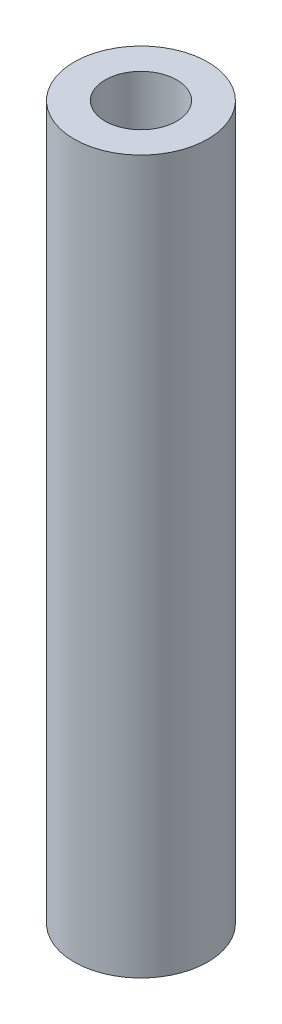
ISO-10303-21;
HEADER;
FILE_DESCRIPTION(('STEP AP214'),'2;1');
FILE_NAME('part.step','',(''),(''),'','','');
FILE_SCHEMA(('AUTOMOTIVE_DESIGN { 1 0 10303 214 1 1 1 1 }'));
ENDSEC;
DATA;
#1=APPLICATION_CONTEXT('core data for automotive mechanical design processes');
#2=APPLICATION_PROTOCOL_DEFINITION('international standard','automotive_design',2000,#1);
#3=PRODUCT_CONTEXT('',#1,'mechanical');
#4=PRODUCT('Part','Part','',(#3));
#5=PRODUCT_RELATED_PRODUCT_CATEGORY('part','',(#4));
#6=PRODUCT_DEFINITION_FORMATION('','',#4);
#7=PRODUCT_DEFINITION_CONTEXT('part definition',#1,'design');
#8=PRODUCT_DEFINITION('design','',#6,#7);
#9=PRODUCT_DEFINITION_SHAPE('','',#8);
#10=(LENGTH_UNIT() NAMED_UNIT(*) SI_UNIT(.MILLI.,.METRE.));
#11=(NAMED_UNIT(*) PLANE_ANGLE_UNIT() SI_UNIT($,.RADIAN.));
#12=(NAMED_UNIT(*) SI_UNIT($,.STERADIAN.) SOLID_ANGLE_UNIT());
#13=UNCERTAINTY_MEASURE_WITH_UNIT(LENGTH_MEASURE(1.E-05),#10,'distance_accuracy_value','');
#14=(GEOMETRIC_REPRESENTATION_CONTEXT(3) GLOBAL_UNCERTAINTY_ASSIGNED_CONTEXT((#13)) GLOBAL_UNIT_ASSIGNED_CONTEXT((#10,
#11,#12)) REPRESENTATION_CONTEXT('',''));
#15=CARTESIAN_POINT('',(0.,0.,0.));
#16=DIRECTION('',(0.,0.,1.));
#17=DIRECTION('',(1.,0.,0.));
#18=AXIS2_PLACEMENT_3D('',#15,#16,#17);
#19=CARTESIAN_POINT('',(0.,25.4,0.));
#20=DIRECTION('',(0.,1.,0.));
#21=DIRECTION('',(0.,0.,1.));
#22=AXIS2_PLACEMENT_3D('',#19,#20,#21);
#23=PLANE('',#22);
#24=CARTESIAN_POINT('',(0.,25.4,0.));
#25=DIRECTION('',(0.,1.,0.));
#26=DIRECTION('',(0.,0.,1.));
#27=AXIS2_PLACEMENT_3D('',#24,#25,#26);
#28=CIRCLE('',#27,4.7625);
#29=CARTESIAN_POINT('',(0.,25.4,4.7625));
#30=VERTEX_POINT('',#29);
#31=EDGE_CURVE('E10',#30,#30,#28,.T.);
#32=ORIENTED_EDGE('',*,*,#31,.T.);
#33=EDGE_LOOP('',(#32));
#34=FACE_BOUND('',#33,.T.);
#35=CARTESIAN_POINT('',(0.,25.4,0.));
#36=DIRECTION('',(0.,1.,0.));
#37=DIRECTION('',(0.,0.,1.));
#38=AXIS2_PLACEMENT_3D('',#35,#36,#37);
#39=CIRCLE('',#38,2.5527);
#40=CARTESIAN_POINT('',(0.,25.4,2.5527));
#41=VERTEX_POINT('',#40);
#42=EDGE_CURVE('E44',#41,#41,#39,.T.);
#43=ORIENTED_EDGE('',*,*,#42,.F.);
#44=EDGE_LOOP('',(#43));
#45=FACE_BOUND('',#44,.T.);
#46=ADVANCED_FACE('F33',(#34,#45),#23,.T.);
#47=CARTESIAN_POINT('',(0.,-25.4,0.));
#48=DIRECTION('',(0.,1.,0.));
#49=DIRECTION('',(0.,0.,1.));
#50=AXIS2_PLACEMENT_3D('',#47,#48,#49);
#51=PLANE('',#50);
#52=CARTESIAN_POINT('',(0.,-25.4,0.));
#53=DIRECTION('',(0.,1.,0.));
#54=DIRECTION('',(0.,0.,1.));
#55=AXIS2_PLACEMENT_3D('',#52,#53,#54);
#56=CIRCLE('',#55,4.7625);
#57=CARTESIAN_POINT('',(0.,-25.4,4.7625));
#58=VERTEX_POINT('',#57);
#59=EDGE_CURVE('E37',#58,#58,#56,.T.);
#60=ORIENTED_EDGE('',*,*,#59,.F.);
#61=EDGE_LOOP('',(#60));
#62=FACE_BOUND('',#61,.T.);
#63=CARTESIAN_POINT('',(0.,-25.4,0.));
#64=DIRECTION('',(0.,1.,0.));
#65=DIRECTION('',(0.,0.,1.));
#66=AXIS2_PLACEMENT_3D('',#63,#64,#65);
#67=CIRCLE('',#66,2.5527);
#68=CARTESIAN_POINT('',(0.,-25.4,2.5527));
#69=VERTEX_POINT('',#68);
#70=EDGE_CURVE('E46',#69,#69,#67,.T.);
#71=ORIENTED_EDGE('',*,*,#70,.T.);
#72=EDGE_LOOP('',(#71));
#73=FACE_BOUND('',#72,.T.);
#74=ADVANCED_FACE('F56',(#62,#73),#51,.F.);
#75=CARTESIAN_POINT('',(0.,25.4,0.));
#76=DIRECTION('',(0.,-1.,0.));
#77=DIRECTION('',(0.,0.,-1.));
#78=AXIS2_PLACEMENT_3D('',#75,#76,#77);
#79=CYLINDRICAL_SURFACE('',#78,4.7625);
#80=ORIENTED_EDGE('',*,*,#31,.F.);
#81=EDGE_LOOP('',(#80));
#82=FACE_BOUND('',#81,.T.);
#83=ORIENTED_EDGE('',*,*,#59,.T.);
#84=EDGE_LOOP('',(#83));
#85=FACE_BOUND('',#84,.T.);
#86=ADVANCED_FACE('F35',(#82,#85),#79,.T.);
#87=CARTESIAN_POINT('',(0.,25.4,0.));
#88=DIRECTION('',(0.,-1.,0.));
#89=DIRECTION('',(0.,0.,-1.));
#90=AXIS2_PLACEMENT_3D('',#87,#88,#89);
#91=CYLINDRICAL_SURFACE('',#90,2.5527);
#92=ORIENTED_EDGE('',*,*,#42,.T.);
#93=EDGE_LOOP('',(#92));
#94=FACE_BOUND('',#93,.T.);
#95=ORIENTED_EDGE('',*,*,#70,.F.);
#96=EDGE_LOOP('',(#95));
#97=FACE_BOUND('',#96,.T.);
#98=ADVANCED_FACE('F52',(#94,#97),#91,.F.);
#99=CLOSED_SHELL('',(#46,#74,#86,#98));
#100=MANIFOLD_SOLID_BREP('B2',#99);
#101=ADVANCED_BREP_SHAPE_REPRESENTATION('',(#18,#100),#14);
#102=SHAPE_DEFINITION_REPRESENTATION(#9,#101);
ENDSEC;
END-ISO-10303-21;
